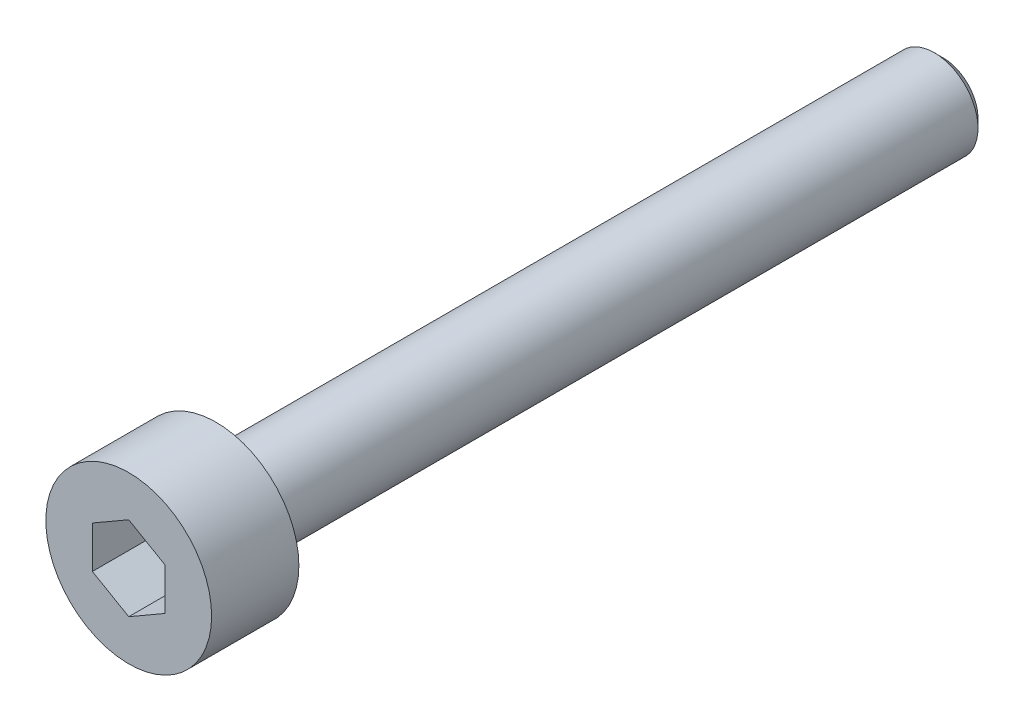
ISO-10303-21;
HEADER;
FILE_DESCRIPTION(('STEP AP214'),'2;1');
FILE_NAME('part.step','',(''),(''),'','','');
FILE_SCHEMA(('AUTOMOTIVE_DESIGN { 1 0 10303 214 1 1 1 1 }'));
ENDSEC;
DATA;
#1=APPLICATION_CONTEXT('core data for automotive mechanical design processes');
#2=APPLICATION_PROTOCOL_DEFINITION('international standard','automotive_design',2000,#1);
#3=PRODUCT_CONTEXT('',#1,'mechanical');
#4=PRODUCT('Part','Part','',(#3));
#5=PRODUCT_RELATED_PRODUCT_CATEGORY('part','',(#4));
#6=PRODUCT_DEFINITION_FORMATION('','',#4);
#7=PRODUCT_DEFINITION_CONTEXT('part definition',#1,'design');
#8=PRODUCT_DEFINITION('design','',#6,#7);
#9=PRODUCT_DEFINITION_SHAPE('','',#8);
#10=(LENGTH_UNIT() NAMED_UNIT(*) SI_UNIT(.MILLI.,.METRE.));
#11=(NAMED_UNIT(*) PLANE_ANGLE_UNIT() SI_UNIT($,.RADIAN.));
#12=(NAMED_UNIT(*) SI_UNIT($,.STERADIAN.) SOLID_ANGLE_UNIT());
#13=UNCERTAINTY_MEASURE_WITH_UNIT(LENGTH_MEASURE(1.E-05),#10,'distance_accuracy_value','');
#14=(GEOMETRIC_REPRESENTATION_CONTEXT(3) GLOBAL_UNCERTAINTY_ASSIGNED_CONTEXT((#13)) GLOBAL_UNIT_ASSIGNED_CONTEXT((#10,
#11,#12)) REPRESENTATION_CONTEXT('',''));
#15=CARTESIAN_POINT('',(0.,0.,0.));
#16=DIRECTION('',(0.,0.,1.));
#17=DIRECTION('',(1.,0.,0.));
#18=AXIS2_PLACEMENT_3D('',#15,#16,#17);
#19=CARTESIAN_POINT('',(0.,0.,0.));
#20=DIRECTION('',(0.,0.,1.));
#21=DIRECTION('',(1.,0.,0.));
#22=AXIS2_PLACEMENT_3D('',#19,#20,#21);
#23=PLANE('',#22);
#24=CARTESIAN_POINT('',(0.,0.,0.));
#25=DIRECTION('',(0.,0.,1.));
#26=DIRECTION('',(1.,0.,0.));
#27=AXIS2_PLACEMENT_3D('',#24,#25,#26);
#28=CIRCLE('',#27,2.85);
#29=CARTESIAN_POINT('',(2.85,0.,0.));
#30=VERTEX_POINT('',#29);
#31=EDGE_CURVE('E137',#30,#30,#28,.T.);
#32=ORIENTED_EDGE('',*,*,#31,.F.);
#33=EDGE_LOOP('',(#32));
#34=FACE_BOUND('',#33,.T.);
#35=CARTESIAN_POINT('',(0.,0.,0.));
#36=DIRECTION('',(0.,0.,1.));
#37=DIRECTION('',(1.,0.,0.));
#38=AXIS2_PLACEMENT_3D('',#35,#36,#37);
#39=CIRCLE('',#38,1.5);
#40=CARTESIAN_POINT('',(1.5,0.,0.));
#41=VERTEX_POINT('',#40);
#42=EDGE_CURVE('E146',#41,#41,#39,.F.);
#43=ORIENTED_EDGE('',*,*,#42,.F.);
#44=EDGE_LOOP('',(#43));
#45=FACE_BOUND('',#44,.T.);
#46=ADVANCED_FACE('F35',(#34,#45),#23,.F.);
#47=CARTESIAN_POINT('',(0.,0.,3.));
#48=DIRECTION('',(0.,0.,-1.));
#49=DIRECTION('',(-1.,0.,0.));
#50=AXIS2_PLACEMENT_3D('',#47,#48,#49);
#51=CYLINDRICAL_SURFACE('',#50,2.85);
#52=CARTESIAN_POINT('',(0.,0.,3.));
#53=DIRECTION('',(0.,0.,1.));
#54=DIRECTION('',(1.,0.,0.));
#55=AXIS2_PLACEMENT_3D('',#52,#53,#54);
#56=CIRCLE('',#55,2.85);
#57=CARTESIAN_POINT('',(2.85,0.,3.));
#58=VERTEX_POINT('',#57);
#59=EDGE_CURVE('E143',#58,#58,#56,.T.);
#60=ORIENTED_EDGE('',*,*,#59,.F.);
#61=EDGE_LOOP('',(#60));
#62=FACE_BOUND('',#61,.T.);
#63=ORIENTED_EDGE('',*,*,#31,.T.);
#64=EDGE_LOOP('',(#63));
#65=FACE_BOUND('',#64,.T.);
#66=ADVANCED_FACE('F168',(#62,#65),#51,.T.);
#67=CARTESIAN_POINT('',(0.,0.,3.));
#68=DIRECTION('',(0.,0.,1.));
#69=DIRECTION('',(1.,0.,0.));
#70=AXIS2_PLACEMENT_3D('',#67,#68,#69);
#71=PLANE('',#70);
#72=DIRECTION('',(-0.866025403784439,0.5,0.));
#73=VECTOR('',#72,1.);
#74=CARTESIAN_POINT('',(1.25,0.721687836487032,3.));
#75=LINE('',#74,#73);
#76=CARTESIAN_POINT('',(1.25,0.721687836487032,3.));
#77=VERTEX_POINT('',#76);
#78=CARTESIAN_POINT('',(0.,1.44337567297406,3.));
#79=VERTEX_POINT('',#78);
#80=EDGE_CURVE('E50',#77,#79,#75,.T.);
#81=ORIENTED_EDGE('',*,*,#80,.F.);
#82=DIRECTION('',(0.,1.,0.));
#83=VECTOR('',#82,1.);
#84=CARTESIAN_POINT('',(1.25,-0.721687836487032,3.));
#85=LINE('',#84,#83);
#86=CARTESIAN_POINT('',(1.25,-0.721687836487032,3.));
#87=VERTEX_POINT('',#86);
#88=EDGE_CURVE('E133',#87,#77,#85,.T.);
#89=ORIENTED_EDGE('',*,*,#88,.F.);
#90=DIRECTION('',(0.866025403784439,0.5,0.));
#91=VECTOR('',#90,1.);
#92=CARTESIAN_POINT('',(0.,-1.44337567297406,3.));
#93=LINE('',#92,#91);
#94=CARTESIAN_POINT('',(0.,-1.44337567297406,3.));
#95=VERTEX_POINT('',#94);
#96=EDGE_CURVE('E131',#95,#87,#93,.T.);
#97=ORIENTED_EDGE('',*,*,#96,.F.);
#98=DIRECTION('',(0.866025403784439,-0.5,0.));
#99=VECTOR('',#98,1.);
#100=CARTESIAN_POINT('',(-1.25,-0.721687836487033,3.));
#101=LINE('',#100,#99);
#102=CARTESIAN_POINT('',(-1.25,-0.721687836487033,3.));
#103=VERTEX_POINT('',#102);
#104=EDGE_CURVE('E98',#103,#95,#101,.T.);
#105=ORIENTED_EDGE('',*,*,#104,.F.);
#106=DIRECTION('',(0.,-1.,0.));
#107=VECTOR('',#106,1.);
#108=CARTESIAN_POINT('',(-1.25,0.721687836487032,3.));
#109=LINE('',#108,#107);
#110=CARTESIAN_POINT('',(-1.25,0.721687836487032,3.));
#111=VERTEX_POINT('',#110);
#112=EDGE_CURVE('E127',#111,#103,#109,.T.);
#113=ORIENTED_EDGE('',*,*,#112,.F.);
#114=DIRECTION('',(-0.866025403784439,-0.5,0.));
#115=VECTOR('',#114,1.);
#116=CARTESIAN_POINT('',(0.,1.44337567297406,3.));
#117=LINE('',#116,#115);
#118=EDGE_CURVE('E124',#79,#111,#117,.T.);
#119=ORIENTED_EDGE('',*,*,#118,.F.);
#120=EDGE_LOOP('',(#81,#89,#97,#105,#113,#119));
#121=FACE_BOUND('',#120,.T.);
#122=ORIENTED_EDGE('',*,*,#59,.T.);
#123=EDGE_LOOP('',(#122));
#124=FACE_BOUND('',#123,.T.);
#125=ADVANCED_FACE('F174',(#121,#124),#71,.T.);
#126=CARTESIAN_POINT('',(0.,0.,-25.));
#127=DIRECTION('',(0.,0.,1.));
#128=DIRECTION('',(1.,0.,0.));
#129=AXIS2_PLACEMENT_3D('',#126,#127,#128);
#130=CYLINDRICAL_SURFACE('',#129,1.5);
#131=CARTESIAN_POINT('',(0.,0.,-24.7));
#132=DIRECTION('',(0.,0.,-1.));
#133=DIRECTION('',(-1.,0.,0.));
#134=AXIS2_PLACEMENT_3D('',#131,#132,#133);
#135=CIRCLE('',#134,1.5);
#136=CARTESIAN_POINT('',(-1.5,0.,-24.7));
#137=VERTEX_POINT('',#136);
#138=EDGE_CURVE('E11',#137,#137,#135,.F.);
#139=ORIENTED_EDGE('',*,*,#138,.T.);
#140=EDGE_LOOP('',(#139));
#141=FACE_BOUND('',#140,.T.);
#142=ORIENTED_EDGE('',*,*,#42,.T.);
#143=EDGE_LOOP('',(#142));
#144=FACE_BOUND('',#143,.T.);
#145=ADVANCED_FACE('F164',(#141,#144),#130,.T.);
#146=CARTESIAN_POINT('',(0.,0.,-25.));
#147=DIRECTION('',(0.,0.,-1.));
#148=DIRECTION('',(-1.,0.,0.));
#149=AXIS2_PLACEMENT_3D('',#146,#147,#148);
#150=PLANE('',#149);
#151=CARTESIAN_POINT('',(0.,0.,-25.));
#152=DIRECTION('',(0.,0.,-1.));
#153=DIRECTION('',(-1.,0.,0.));
#154=AXIS2_PLACEMENT_3D('',#151,#152,#153);
#155=CIRCLE('',#154,1.2);
#156=CARTESIAN_POINT('',(-1.2,0.,-25.));
#157=VERTEX_POINT('',#156);
#158=EDGE_CURVE('E43',#157,#157,#155,.T.);
#159=ORIENTED_EDGE('',*,*,#158,.T.);
#160=EDGE_LOOP('',(#159));
#161=FACE_BOUND('',#160,.T.);
#162=ADVANCED_FACE('F153',(#161),#150,.T.);
#163=CARTESIAN_POINT('',(0.,0.,-25.));
#164=DIRECTION('',(0.,0.,1.));
#165=DIRECTION('',(1.,0.,0.));
#166=AXIS2_PLACEMENT_3D('',#163,#164,#165);
#167=CONICAL_SURFACE('',#166,1.2,0.785398163397447);
#168=ORIENTED_EDGE('',*,*,#138,.F.);
#169=EDGE_LOOP('',(#168));
#170=FACE_BOUND('',#169,.T.);
#171=ORIENTED_EDGE('',*,*,#158,.F.);
#172=EDGE_LOOP('',(#171));
#173=FACE_BOUND('',#172,.T.);
#174=ADVANCED_FACE('F37',(#170,#173),#167,.T.);
#175=CARTESIAN_POINT('',(1.25,0.721687836487032,1.));
#176=DIRECTION('',(0.5,0.866025403784439,0.));
#177=DIRECTION('',(-0.866025403784439,0.5,0.));
#178=AXIS2_PLACEMENT_3D('',#175,#176,#177);
#179=PLANE('',#178);
#180=ORIENTED_EDGE('',*,*,#80,.T.);
#181=DIRECTION('',(0.,0.,1.));
#182=VECTOR('',#181,1.);
#183=CARTESIAN_POINT('',(0.,1.44337567297406,1.));
#184=LINE('',#183,#182);
#185=CARTESIAN_POINT('',(0.,1.44337567297406,1.));
#186=VERTEX_POINT('',#185);
#187=EDGE_CURVE('E80',#186,#79,#184,.T.);
#188=ORIENTED_EDGE('',*,*,#187,.F.);
#189=DIRECTION('',(-0.866025403784439,0.5,0.));
#190=VECTOR('',#189,1.);
#191=CARTESIAN_POINT('',(1.25,0.721687836487032,1.));
#192=LINE('',#191,#190);
#193=CARTESIAN_POINT('',(1.25,0.721687836487032,1.));
#194=VERTEX_POINT('',#193);
#195=EDGE_CURVE('E135',#194,#186,#192,.T.);
#196=ORIENTED_EDGE('',*,*,#195,.F.);
#197=DIRECTION('',(0.,0.,1.));
#198=VECTOR('',#197,1.);
#199=CARTESIAN_POINT('',(1.25,0.721687836487032,1.));
#200=LINE('',#199,#198);
#201=EDGE_CURVE('E58',#194,#77,#200,.T.);
#202=ORIENTED_EDGE('',*,*,#201,.T.);
#203=EDGE_LOOP('',(#180,#188,#196,#202));
#204=FACE_BOUND('',#203,.T.);
#205=ADVANCED_FACE('F156',(#204),#179,.F.);
#206=CARTESIAN_POINT('',(1.25,-0.721687836487032,1.));
#207=DIRECTION('',(1.,0.,0.));
#208=DIRECTION('',(0.,1.,0.));
#209=AXIS2_PLACEMENT_3D('',#206,#207,#208);
#210=PLANE('',#209);
#211=ORIENTED_EDGE('',*,*,#88,.T.);
#212=ORIENTED_EDGE('',*,*,#201,.F.);
#213=DIRECTION('',(0.,1.,0.));
#214=VECTOR('',#213,1.);
#215=CARTESIAN_POINT('',(1.25,-0.721687836487032,1.));
#216=LINE('',#215,#214);
#217=CARTESIAN_POINT('',(1.25,-0.721687836487032,1.));
#218=VERTEX_POINT('',#217);
#219=EDGE_CURVE('E110',#218,#194,#216,.T.);
#220=ORIENTED_EDGE('',*,*,#219,.F.);
#221=DIRECTION('',(0.,0.,1.));
#222=VECTOR('',#221,1.);
#223=CARTESIAN_POINT('',(1.25,-0.721687836487032,1.));
#224=LINE('',#223,#222);
#225=EDGE_CURVE('E102',#218,#87,#224,.T.);
#226=ORIENTED_EDGE('',*,*,#225,.T.);
#227=EDGE_LOOP('',(#211,#212,#220,#226));
#228=FACE_BOUND('',#227,.T.);
#229=ADVANCED_FACE('F162',(#228),#210,.F.);
#230=CARTESIAN_POINT('',(0.,-1.44337567297406,1.));
#231=DIRECTION('',(0.5,-0.866025403784439,0.));
#232=DIRECTION('',(0.866025403784439,0.5,0.));
#233=AXIS2_PLACEMENT_3D('',#230,#231,#232);
#234=PLANE('',#233);
#235=ORIENTED_EDGE('',*,*,#96,.T.);
#236=ORIENTED_EDGE('',*,*,#225,.F.);
#237=DIRECTION('',(0.866025403784439,0.5,0.));
#238=VECTOR('',#237,1.);
#239=CARTESIAN_POINT('',(0.,-1.44337567297406,1.));
#240=LINE('',#239,#238);
#241=CARTESIAN_POINT('',(0.,-1.44337567297406,1.));
#242=VERTEX_POINT('',#241);
#243=EDGE_CURVE('E106',#242,#218,#240,.T.);
#244=ORIENTED_EDGE('',*,*,#243,.F.);
#245=DIRECTION('',(0.,0.,1.));
#246=VECTOR('',#245,1.);
#247=CARTESIAN_POINT('',(0.,-1.44337567297406,1.));
#248=LINE('',#247,#246);
#249=EDGE_CURVE('E91',#242,#95,#248,.T.);
#250=ORIENTED_EDGE('',*,*,#249,.T.);
#251=EDGE_LOOP('',(#235,#236,#244,#250));
#252=FACE_BOUND('',#251,.T.);
#253=ADVANCED_FACE('F107',(#252),#234,.F.);
#254=CARTESIAN_POINT('',(-1.25,-0.721687836487033,1.));
#255=DIRECTION('',(-0.5,-0.866025403784439,0.));
#256=DIRECTION('',(0.866025403784439,-0.5,0.));
#257=AXIS2_PLACEMENT_3D('',#254,#255,#256);
#258=PLANE('',#257);
#259=ORIENTED_EDGE('',*,*,#104,.T.);
#260=ORIENTED_EDGE('',*,*,#249,.F.);
#261=DIRECTION('',(0.866025403784439,-0.5,0.));
#262=VECTOR('',#261,1.);
#263=CARTESIAN_POINT('',(-1.25,-0.721687836487033,1.));
#264=LINE('',#263,#262);
#265=CARTESIAN_POINT('',(-1.25,-0.721687836487033,1.));
#266=VERTEX_POINT('',#265);
#267=EDGE_CURVE('E95',#266,#242,#264,.T.);
#268=ORIENTED_EDGE('',*,*,#267,.F.);
#269=DIRECTION('',(0.,0.,1.));
#270=VECTOR('',#269,1.);
#271=CARTESIAN_POINT('',(-1.25,-0.721687836487033,1.));
#272=LINE('',#271,#270);
#273=EDGE_CURVE('E103',#266,#103,#272,.T.);
#274=ORIENTED_EDGE('',*,*,#273,.T.);
#275=EDGE_LOOP('',(#259,#260,#268,#274));
#276=FACE_BOUND('',#275,.T.);
#277=ADVANCED_FACE('F93',(#276),#258,.F.);
#278=CARTESIAN_POINT('',(-1.25,0.721687836487032,1.));
#279=DIRECTION('',(-1.,0.,0.));
#280=DIRECTION('',(0.,0.,1.));
#281=AXIS2_PLACEMENT_3D('',#278,#279,#280);
#282=PLANE('',#281);
#283=ORIENTED_EDGE('',*,*,#112,.T.);
#284=ORIENTED_EDGE('',*,*,#273,.F.);
#285=DIRECTION('',(0.,-1.,0.));
#286=VECTOR('',#285,1.);
#287=CARTESIAN_POINT('',(-1.25,0.721687836487032,1.));
#288=LINE('',#287,#286);
#289=CARTESIAN_POINT('',(-1.25,0.721687836487032,1.));
#290=VERTEX_POINT('',#289);
#291=EDGE_CURVE('E116',#290,#266,#288,.T.);
#292=ORIENTED_EDGE('',*,*,#291,.F.);
#293=DIRECTION('',(0.,0.,1.));
#294=VECTOR('',#293,1.);
#295=CARTESIAN_POINT('',(-1.25,0.721687836487032,1.));
#296=LINE('',#295,#294);
#297=EDGE_CURVE('E140',#290,#111,#296,.T.);
#298=ORIENTED_EDGE('',*,*,#297,.T.);
#299=EDGE_LOOP('',(#283,#284,#292,#298));
#300=FACE_BOUND('',#299,.T.);
#301=ADVANCED_FACE('F188',(#300),#282,.F.);
#302=CARTESIAN_POINT('',(0.,1.44337567297406,1.));
#303=DIRECTION('',(-0.5,0.866025403784439,0.));
#304=DIRECTION('',(-0.866025403784439,-0.5,0.));
#305=AXIS2_PLACEMENT_3D('',#302,#303,#304);
#306=PLANE('',#305);
#307=ORIENTED_EDGE('',*,*,#118,.T.);
#308=ORIENTED_EDGE('',*,*,#297,.F.);
#309=DIRECTION('',(-0.866025403784439,-0.5,0.));
#310=VECTOR('',#309,1.);
#311=CARTESIAN_POINT('',(0.,1.44337567297406,1.));
#312=LINE('',#311,#310);
#313=EDGE_CURVE('E118',#186,#290,#312,.T.);
#314=ORIENTED_EDGE('',*,*,#313,.F.);
#315=ORIENTED_EDGE('',*,*,#187,.T.);
#316=EDGE_LOOP('',(#307,#308,#314,#315));
#317=FACE_BOUND('',#316,.T.);
#318=ADVANCED_FACE('F185',(#317),#306,.F.);
#319=CARTESIAN_POINT('',(0.,0.,1.));
#320=DIRECTION('',(0.,0.,1.));
#321=DIRECTION('',(1.,0.,0.));
#322=AXIS2_PLACEMENT_3D('',#319,#320,#321);
#323=PLANE('',#322);
#324=ORIENTED_EDGE('',*,*,#195,.T.);
#325=ORIENTED_EDGE('',*,*,#313,.T.);
#326=ORIENTED_EDGE('',*,*,#291,.T.);
#327=ORIENTED_EDGE('',*,*,#267,.T.);
#328=ORIENTED_EDGE('',*,*,#243,.T.);
#329=ORIENTED_EDGE('',*,*,#219,.T.);
#330=EDGE_LOOP('',(#324,#325,#326,#327,#328,#329));
#331=FACE_BOUND('',#330,.T.);
#332=ADVANCED_FACE('F113',(#331),#323,.T.);
#333=CLOSED_SHELL('',(#46,#66,#125,#145,#162,#174,#205,#229,#253,#277,#301,#318,#332));
#334=MANIFOLD_SOLID_BREP('B2',#333);
#335=ADVANCED_BREP_SHAPE_REPRESENTATION('',(#18,#334),#14);
#336=SHAPE_DEFINITION_REPRESENTATION(#9,#335);
ENDSEC;
END-ISO-10303-21;
